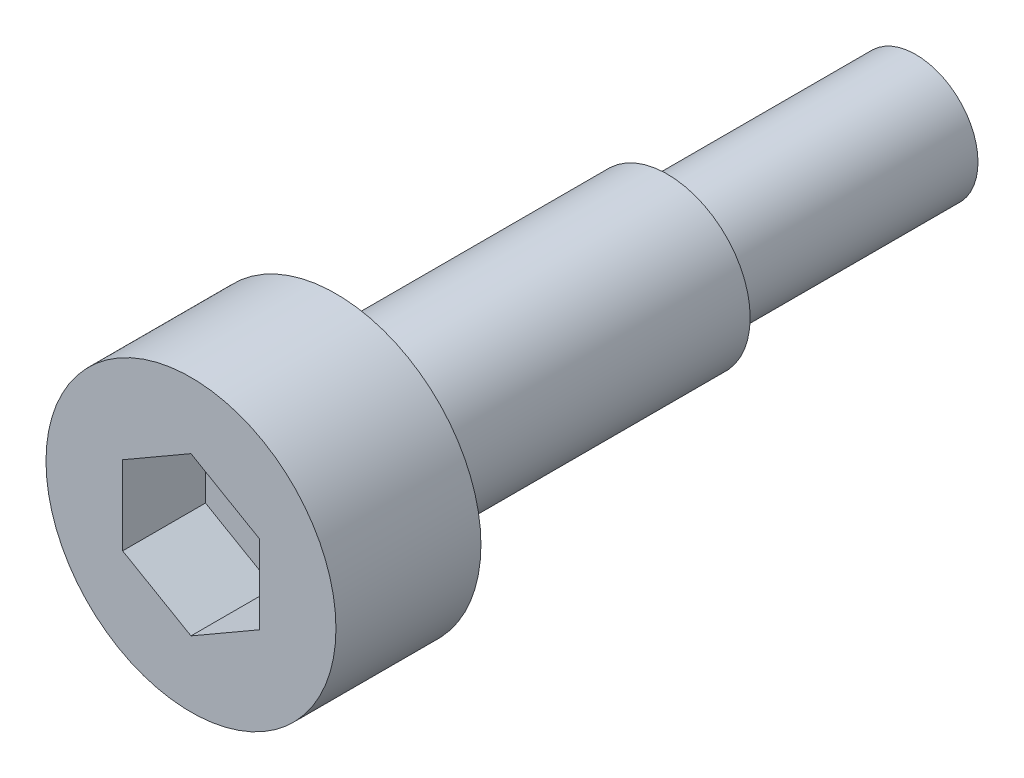
ISO-10303-21;
HEADER;
FILE_DESCRIPTION(('STEP AP214'),'2;1');
FILE_NAME('part.step','',(''),(''),'','','');
FILE_SCHEMA(('AUTOMOTIVE_DESIGN { 1 0 10303 214 1 1 1 1 }'));
ENDSEC;
DATA;
#1=APPLICATION_CONTEXT('core data for automotive mechanical design processes');
#2=APPLICATION_PROTOCOL_DEFINITION('international standard','automotive_design',2000,#1);
#3=PRODUCT_CONTEXT('',#1,'mechanical');
#4=PRODUCT('Part','Part','',(#3));
#5=PRODUCT_RELATED_PRODUCT_CATEGORY('part','',(#4));
#6=PRODUCT_DEFINITION_FORMATION('','',#4);
#7=PRODUCT_DEFINITION_CONTEXT('part definition',#1,'design');
#8=PRODUCT_DEFINITION('design','',#6,#7);
#9=PRODUCT_DEFINITION_SHAPE('','',#8);
#10=(LENGTH_UNIT() NAMED_UNIT(*) SI_UNIT(.MILLI.,.METRE.));
#11=(NAMED_UNIT(*) PLANE_ANGLE_UNIT() SI_UNIT($,.RADIAN.));
#12=(NAMED_UNIT(*) SI_UNIT($,.STERADIAN.) SOLID_ANGLE_UNIT());
#13=UNCERTAINTY_MEASURE_WITH_UNIT(LENGTH_MEASURE(1.E-05),#10,'distance_accuracy_value','');
#14=(GEOMETRIC_REPRESENTATION_CONTEXT(3) GLOBAL_UNCERTAINTY_ASSIGNED_CONTEXT((#13)) GLOBAL_UNIT_ASSIGNED_CONTEXT((#10,
#11,#12)) REPRESENTATION_CONTEXT('',''));
#15=CARTESIAN_POINT('',(0.,0.,0.));
#16=DIRECTION('',(0.,0.,1.));
#17=DIRECTION('',(1.,0.,0.));
#18=AXIS2_PLACEMENT_3D('',#15,#16,#17);
#19=CARTESIAN_POINT('',(0.,0.,6.));
#20=DIRECTION('',(0.,0.,-1.));
#21=DIRECTION('',(-1.,0.,0.));
#22=AXIS2_PLACEMENT_3D('',#19,#20,#21);
#23=CYLINDRICAL_SURFACE('',#22,1.5);
#24=CARTESIAN_POINT('',(0.,0.,6.));
#25=DIRECTION('',(0.,0.,1.));
#26=DIRECTION('',(1.,0.,0.));
#27=AXIS2_PLACEMENT_3D('',#24,#25,#26);
#28=CIRCLE('',#27,1.5);
#29=CARTESIAN_POINT('',(1.5,0.,6.));
#30=VERTEX_POINT('',#29);
#31=EDGE_CURVE('E11',#30,#30,#28,.T.);
#32=ORIENTED_EDGE('',*,*,#31,.F.);
#33=EDGE_LOOP('',(#32));
#34=FACE_BOUND('',#33,.T.);
#35=CARTESIAN_POINT('',(0.,0.,0.));
#36=DIRECTION('',(0.,0.,1.));
#37=DIRECTION('',(1.,0.,0.));
#38=AXIS2_PLACEMENT_3D('',#35,#36,#37);
#39=CIRCLE('',#38,1.5);
#40=CARTESIAN_POINT('',(1.5,0.,0.));
#41=VERTEX_POINT('',#40);
#42=EDGE_CURVE('E38',#41,#41,#39,.T.);
#43=ORIENTED_EDGE('',*,*,#42,.T.);
#44=EDGE_LOOP('',(#43));
#45=FACE_BOUND('',#44,.T.);
#46=ADVANCED_FACE('F35',(#34,#45),#23,.T.);
#47=CARTESIAN_POINT('',(0.,0.,0.));
#48=DIRECTION('',(0.,0.,1.));
#49=DIRECTION('',(1.,0.,0.));
#50=AXIS2_PLACEMENT_3D('',#47,#48,#49);
#51=PLANE('',#50);
#52=ORIENTED_EDGE('',*,*,#42,.F.);
#53=EDGE_LOOP('',(#52));
#54=FACE_BOUND('',#53,.T.);
#55=ADVANCED_FACE('F168',(#54),#51,.F.);
#56=CARTESIAN_POINT('',(0.,0.,14.));
#57=DIRECTION('',(0.,0.,-1.));
#58=DIRECTION('',(-1.,0.,0.));
#59=AXIS2_PLACEMENT_3D('',#56,#57,#58);
#60=CYLINDRICAL_SURFACE('',#59,2.);
#61=CARTESIAN_POINT('',(0.,0.,14.));
#62=DIRECTION('',(0.,0.,1.));
#63=DIRECTION('',(1.,0.,0.));
#64=AXIS2_PLACEMENT_3D('',#61,#62,#63);
#65=CIRCLE('',#64,2.);
#66=CARTESIAN_POINT('',(2.,0.,14.));
#67=VERTEX_POINT('',#66);
#68=EDGE_CURVE('E148',#67,#67,#65,.T.);
#69=ORIENTED_EDGE('',*,*,#68,.F.);
#70=EDGE_LOOP('',(#69));
#71=FACE_BOUND('',#70,.T.);
#72=CARTESIAN_POINT('',(0.,0.,6.));
#73=DIRECTION('',(0.,0.,1.));
#74=DIRECTION('',(1.,0.,0.));
#75=AXIS2_PLACEMENT_3D('',#72,#73,#74);
#76=CIRCLE('',#75,2.);
#77=CARTESIAN_POINT('',(2.,0.,6.));
#78=VERTEX_POINT('',#77);
#79=EDGE_CURVE('E145',#78,#78,#76,.T.);
#80=ORIENTED_EDGE('',*,*,#79,.T.);
#81=EDGE_LOOP('',(#80));
#82=FACE_BOUND('',#81,.T.);
#83=ADVANCED_FACE('F154',(#71,#82),#60,.T.);
#84=CARTESIAN_POINT('',(0.,0.,6.));
#85=DIRECTION('',(0.,0.,1.));
#86=DIRECTION('',(1.,0.,0.));
#87=AXIS2_PLACEMENT_3D('',#84,#85,#86);
#88=PLANE('',#87);
#89=ORIENTED_EDGE('',*,*,#31,.T.);
#90=EDGE_LOOP('',(#89));
#91=FACE_BOUND('',#90,.T.);
#92=ORIENTED_EDGE('',*,*,#79,.F.);
#93=EDGE_LOOP('',(#92));
#94=FACE_BOUND('',#93,.T.);
#95=ADVANCED_FACE('F156',(#91,#94),#88,.F.);
#96=CARTESIAN_POINT('',(0.,0.,17.5));
#97=DIRECTION('',(0.,0.,-1.));
#98=DIRECTION('',(-1.,0.,0.));
#99=AXIS2_PLACEMENT_3D('',#96,#97,#98);
#100=CYLINDRICAL_SURFACE('',#99,3.5);
#101=CARTESIAN_POINT('',(0.,0.,17.5));
#102=DIRECTION('',(0.,0.,1.));
#103=DIRECTION('',(1.,0.,0.));
#104=AXIS2_PLACEMENT_3D('',#101,#102,#103);
#105=CIRCLE('',#104,3.5);
#106=CARTESIAN_POINT('',(3.5,0.,17.5));
#107=VERTEX_POINT('',#106);
#108=EDGE_CURVE('E142',#107,#107,#105,.T.);
#109=ORIENTED_EDGE('',*,*,#108,.F.);
#110=EDGE_LOOP('',(#109));
#111=FACE_BOUND('',#110,.T.);
#112=CARTESIAN_POINT('',(0.,0.,14.));
#113=DIRECTION('',(0.,0.,1.));
#114=DIRECTION('',(1.,0.,0.));
#115=AXIS2_PLACEMENT_3D('',#112,#113,#114);
#116=CIRCLE('',#115,3.5);
#117=CARTESIAN_POINT('',(3.5,0.,14.));
#118=VERTEX_POINT('',#117);
#119=EDGE_CURVE('E136',#118,#118,#116,.T.);
#120=ORIENTED_EDGE('',*,*,#119,.T.);
#121=EDGE_LOOP('',(#120));
#122=FACE_BOUND('',#121,.T.);
#123=ADVANCED_FACE('F158',(#111,#122),#100,.T.);
#124=CARTESIAN_POINT('',(0.,0.,17.5));
#125=DIRECTION('',(0.,0.,1.));
#126=DIRECTION('',(1.,0.,0.));
#127=AXIS2_PLACEMENT_3D('',#124,#125,#126);
#128=PLANE('',#127);
#129=DIRECTION('',(-0.866025403784439,0.5,0.));
#130=VECTOR('',#129,1.);
#131=CARTESIAN_POINT('',(1.65,0.952627944162884,17.5));
#132=LINE('',#131,#130);
#133=CARTESIAN_POINT('',(1.65,0.952627944162884,17.5));
#134=VERTEX_POINT('',#133);
#135=CARTESIAN_POINT('',(0.,1.90525588832577,17.5));
#136=VERTEX_POINT('',#135);
#137=EDGE_CURVE('E49',#134,#136,#132,.T.);
#138=ORIENTED_EDGE('',*,*,#137,.F.);
#139=DIRECTION('',(0.,1.,0.));
#140=VECTOR('',#139,1.);
#141=CARTESIAN_POINT('',(1.65,-0.952627944162883,17.5));
#142=LINE('',#141,#140);
#143=CARTESIAN_POINT('',(1.65,-0.952627944162883,17.5));
#144=VERTEX_POINT('',#143);
#145=EDGE_CURVE('E132',#144,#134,#142,.T.);
#146=ORIENTED_EDGE('',*,*,#145,.F.);
#147=DIRECTION('',(0.866025403784439,0.5,0.));
#148=VECTOR('',#147,1.);
#149=CARTESIAN_POINT('',(0.,-1.90525588832576,17.5));
#150=LINE('',#149,#148);
#151=CARTESIAN_POINT('',(0.,-1.90525588832576,17.5));
#152=VERTEX_POINT('',#151);
#153=EDGE_CURVE('E130',#152,#144,#150,.T.);
#154=ORIENTED_EDGE('',*,*,#153,.F.);
#155=DIRECTION('',(0.866025403784438,-0.5,0.));
#156=VECTOR('',#155,1.);
#157=CARTESIAN_POINT('',(-1.65,-0.952627944162882,17.5));
#158=LINE('',#157,#156);
#159=CARTESIAN_POINT('',(-1.65,-0.952627944162882,17.5));
#160=VERTEX_POINT('',#159);
#161=EDGE_CURVE('E97',#160,#152,#158,.T.);
#162=ORIENTED_EDGE('',*,*,#161,.F.);
#163=DIRECTION('',(0.,-1.,0.));
#164=VECTOR('',#163,1.);
#165=CARTESIAN_POINT('',(-1.65,0.952627944162884,17.5));
#166=LINE('',#165,#164);
#167=CARTESIAN_POINT('',(-1.65,0.952627944162884,17.5));
#168=VERTEX_POINT('',#167);
#169=EDGE_CURVE('E126',#168,#160,#166,.T.);
#170=ORIENTED_EDGE('',*,*,#169,.F.);
#171=DIRECTION('',(-0.866025403784439,-0.5,0.));
#172=VECTOR('',#171,1.);
#173=CARTESIAN_POINT('',(0.,1.90525588832577,17.5));
#174=LINE('',#173,#172);
#175=EDGE_CURVE('E123',#136,#168,#174,.T.);
#176=ORIENTED_EDGE('',*,*,#175,.F.);
#177=EDGE_LOOP('',(#138,#146,#154,#162,#170,#176));
#178=FACE_BOUND('',#177,.T.);
#179=ORIENTED_EDGE('',*,*,#108,.T.);
#180=EDGE_LOOP('',(#179));
#181=FACE_BOUND('',#180,.T.);
#182=ADVANCED_FACE('F165',(#178,#181),#128,.T.);
#183=CARTESIAN_POINT('',(0.,0.,14.));
#184=DIRECTION('',(0.,0.,1.));
#185=DIRECTION('',(1.,0.,0.));
#186=AXIS2_PLACEMENT_3D('',#183,#184,#185);
#187=PLANE('',#186);
#188=ORIENTED_EDGE('',*,*,#68,.T.);
#189=EDGE_LOOP('',(#188));
#190=FACE_BOUND('',#189,.T.);
#191=ORIENTED_EDGE('',*,*,#119,.F.);
#192=EDGE_LOOP('',(#191));
#193=FACE_BOUND('',#192,.T.);
#194=ADVANCED_FACE('F205',(#190,#193),#187,.F.);
#195=CARTESIAN_POINT('',(1.65,0.952627944162884,15.5));
#196=DIRECTION('',(0.5,0.866025403784439,0.));
#197=DIRECTION('',(-0.866025403784439,0.5,0.));
#198=AXIS2_PLACEMENT_3D('',#195,#196,#197);
#199=PLANE('',#198);
#200=ORIENTED_EDGE('',*,*,#137,.T.);
#201=DIRECTION('',(0.,0.,1.));
#202=VECTOR('',#201,1.);
#203=CARTESIAN_POINT('',(0.,1.90525588832577,15.5));
#204=LINE('',#203,#202);
#205=CARTESIAN_POINT('',(0.,1.90525588832577,15.5));
#206=VERTEX_POINT('',#205);
#207=EDGE_CURVE('E79',#206,#136,#204,.T.);
#208=ORIENTED_EDGE('',*,*,#207,.F.);
#209=DIRECTION('',(-0.866025403784439,0.5,0.));
#210=VECTOR('',#209,1.);
#211=CARTESIAN_POINT('',(1.65,0.952627944162884,15.5));
#212=LINE('',#211,#210);
#213=CARTESIAN_POINT('',(1.65,0.952627944162884,15.5));
#214=VERTEX_POINT('',#213);
#215=EDGE_CURVE('E134',#214,#206,#212,.T.);
#216=ORIENTED_EDGE('',*,*,#215,.F.);
#217=DIRECTION('',(0.,0.,1.));
#218=VECTOR('',#217,1.);
#219=CARTESIAN_POINT('',(1.65,0.952627944162884,15.5));
#220=LINE('',#219,#218);
#221=EDGE_CURVE('E57',#214,#134,#220,.T.);
#222=ORIENTED_EDGE('',*,*,#221,.T.);
#223=EDGE_LOOP('',(#200,#208,#216,#222));
#224=FACE_BOUND('',#223,.T.);
#225=ADVANCED_FACE('F210',(#224),#199,.F.);
#226=CARTESIAN_POINT('',(1.65,-0.952627944162883,15.5));
#227=DIRECTION('',(1.,0.,0.));
#228=DIRECTION('',(0.,0.,-1.));
#229=AXIS2_PLACEMENT_3D('',#226,#227,#228);
#230=PLANE('',#229);
#231=ORIENTED_EDGE('',*,*,#145,.T.);
#232=ORIENTED_EDGE('',*,*,#221,.F.);
#233=DIRECTION('',(0.,1.,0.));
#234=VECTOR('',#233,1.);
#235=CARTESIAN_POINT('',(1.65,-0.952627944162883,15.5));
#236=LINE('',#235,#234);
#237=CARTESIAN_POINT('',(1.65,-0.952627944162883,15.5));
#238=VERTEX_POINT('',#237);
#239=EDGE_CURVE('E109',#238,#214,#236,.T.);
#240=ORIENTED_EDGE('',*,*,#239,.F.);
#241=DIRECTION('',(0.,0.,1.));
#242=VECTOR('',#241,1.);
#243=CARTESIAN_POINT('',(1.65,-0.952627944162883,15.5));
#244=LINE('',#243,#242);
#245=EDGE_CURVE('E101',#238,#144,#244,.T.);
#246=ORIENTED_EDGE('',*,*,#245,.T.);
#247=EDGE_LOOP('',(#231,#232,#240,#246));
#248=FACE_BOUND('',#247,.T.);
#249=ADVANCED_FACE('F227',(#248),#230,.F.);
#250=CARTESIAN_POINT('',(0.,-1.90525588832576,15.5));
#251=DIRECTION('',(0.5,-0.866025403784439,0.));
#252=DIRECTION('',(0.866025403784439,0.5,0.));
#253=AXIS2_PLACEMENT_3D('',#250,#251,#252);
#254=PLANE('',#253);
#255=ORIENTED_EDGE('',*,*,#153,.T.);
#256=ORIENTED_EDGE('',*,*,#245,.F.);
#257=DIRECTION('',(0.866025403784439,0.5,0.));
#258=VECTOR('',#257,1.);
#259=CARTESIAN_POINT('',(0.,-1.90525588832576,15.5));
#260=LINE('',#259,#258);
#261=CARTESIAN_POINT('',(0.,-1.90525588832576,15.5));
#262=VERTEX_POINT('',#261);
#263=EDGE_CURVE('E105',#262,#238,#260,.T.);
#264=ORIENTED_EDGE('',*,*,#263,.F.);
#265=DIRECTION('',(0.,0.,1.));
#266=VECTOR('',#265,1.);
#267=CARTESIAN_POINT('',(0.,-1.90525588832576,15.5));
#268=LINE('',#267,#266);
#269=EDGE_CURVE('E90',#262,#152,#268,.T.);
#270=ORIENTED_EDGE('',*,*,#269,.T.);
#271=EDGE_LOOP('',(#255,#256,#264,#270));
#272=FACE_BOUND('',#271,.T.);
#273=ADVANCED_FACE('F106',(#272),#254,.F.);
#274=CARTESIAN_POINT('',(-1.65,-0.952627944162882,15.5));
#275=DIRECTION('',(-0.5,-0.866025403784439,0.));
#276=DIRECTION('',(0.866025403784438,-0.5,0.));
#277=AXIS2_PLACEMENT_3D('',#274,#275,#276);
#278=PLANE('',#277);
#279=ORIENTED_EDGE('',*,*,#161,.T.);
#280=ORIENTED_EDGE('',*,*,#269,.F.);
#281=DIRECTION('',(0.866025403784438,-0.5,0.));
#282=VECTOR('',#281,1.);
#283=CARTESIAN_POINT('',(-1.65,-0.952627944162882,15.5));
#284=LINE('',#283,#282);
#285=CARTESIAN_POINT('',(-1.65,-0.952627944162882,15.5));
#286=VERTEX_POINT('',#285);
#287=EDGE_CURVE('E94',#286,#262,#284,.T.);
#288=ORIENTED_EDGE('',*,*,#287,.F.);
#289=DIRECTION('',(0.,0.,1.));
#290=VECTOR('',#289,1.);
#291=CARTESIAN_POINT('',(-1.65,-0.952627944162882,15.5));
#292=LINE('',#291,#290);
#293=EDGE_CURVE('E102',#286,#160,#292,.T.);
#294=ORIENTED_EDGE('',*,*,#293,.T.);
#295=EDGE_LOOP('',(#279,#280,#288,#294));
#296=FACE_BOUND('',#295,.T.);
#297=ADVANCED_FACE('F92',(#296),#278,.F.);
#298=CARTESIAN_POINT('',(-1.65,0.952627944162884,15.5));
#299=DIRECTION('',(-1.,0.,0.));
#300=DIRECTION('',(0.,-1.,0.));
#301=AXIS2_PLACEMENT_3D('',#298,#299,#300);
#302=PLANE('',#301);
#303=ORIENTED_EDGE('',*,*,#169,.T.);
#304=ORIENTED_EDGE('',*,*,#293,.F.);
#305=DIRECTION('',(0.,-1.,0.));
#306=VECTOR('',#305,1.);
#307=CARTESIAN_POINT('',(-1.65,0.952627944162884,15.5));
#308=LINE('',#307,#306);
#309=CARTESIAN_POINT('',(-1.65,0.952627944162884,15.5));
#310=VERTEX_POINT('',#309);
#311=EDGE_CURVE('E115',#310,#286,#308,.T.);
#312=ORIENTED_EDGE('',*,*,#311,.F.);
#313=DIRECTION('',(0.,0.,1.));
#314=VECTOR('',#313,1.);
#315=CARTESIAN_POINT('',(-1.65,0.952627944162884,15.5));
#316=LINE('',#315,#314);
#317=EDGE_CURVE('E139',#310,#168,#316,.T.);
#318=ORIENTED_EDGE('',*,*,#317,.T.);
#319=EDGE_LOOP('',(#303,#304,#312,#318));
#320=FACE_BOUND('',#319,.T.);
#321=ADVANCED_FACE('F252',(#320),#302,.F.);
#322=CARTESIAN_POINT('',(0.,1.90525588832577,15.5));
#323=DIRECTION('',(-0.5,0.866025403784439,0.));
#324=DIRECTION('',(-0.866025403784439,-0.5,0.));
#325=AXIS2_PLACEMENT_3D('',#322,#323,#324);
#326=PLANE('',#325);
#327=ORIENTED_EDGE('',*,*,#175,.T.);
#328=ORIENTED_EDGE('',*,*,#317,.F.);
#329=DIRECTION('',(-0.866025403784439,-0.5,0.));
#330=VECTOR('',#329,1.);
#331=CARTESIAN_POINT('',(0.,1.90525588832577,15.5));
#332=LINE('',#331,#330);
#333=EDGE_CURVE('E117',#206,#310,#332,.T.);
#334=ORIENTED_EDGE('',*,*,#333,.F.);
#335=ORIENTED_EDGE('',*,*,#207,.T.);
#336=EDGE_LOOP('',(#327,#328,#334,#335));
#337=FACE_BOUND('',#336,.T.);
#338=ADVANCED_FACE('F261',(#337),#326,.F.);
#339=CARTESIAN_POINT('',(0.,0.,15.5));
#340=DIRECTION('',(0.,0.,1.));
#341=DIRECTION('',(1.,0.,0.));
#342=AXIS2_PLACEMENT_3D('',#339,#340,#341);
#343=PLANE('',#342);
#344=ORIENTED_EDGE('',*,*,#215,.T.);
#345=ORIENTED_EDGE('',*,*,#333,.T.);
#346=ORIENTED_EDGE('',*,*,#311,.T.);
#347=ORIENTED_EDGE('',*,*,#287,.T.);
#348=ORIENTED_EDGE('',*,*,#263,.T.);
#349=ORIENTED_EDGE('',*,*,#239,.T.);
#350=EDGE_LOOP('',(#344,#345,#346,#347,#348,#349));
#351=FACE_BOUND('',#350,.T.);
#352=ADVANCED_FACE('F112',(#351),#343,.T.);
#353=CLOSED_SHELL('',(#46,#55,#83,#95,#123,#182,#194,#225,#249,#273,#297,#321,#338,#352));
#354=MANIFOLD_SOLID_BREP('B2',#353);
#355=ADVANCED_BREP_SHAPE_REPRESENTATION('',(#18,#354),#14);
#356=SHAPE_DEFINITION_REPRESENTATION(#9,#355);
ENDSEC;
END-ISO-10303-21;
